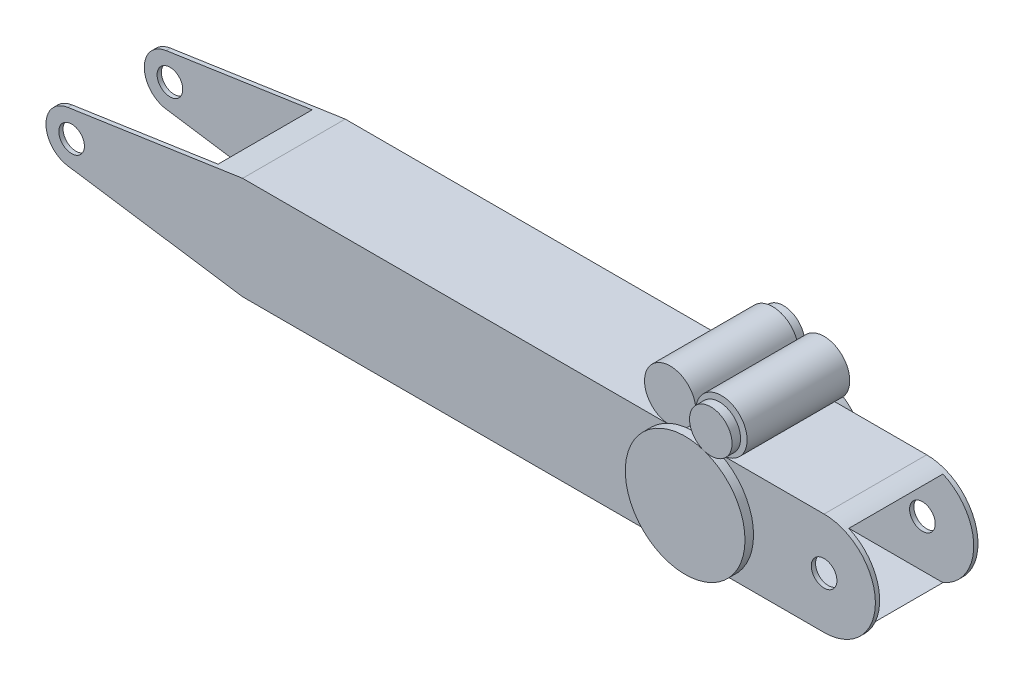
ISO-10303-21;
HEADER;
FILE_DESCRIPTION(('STEP AP214'),'2;1');
FILE_NAME('part.step','',(''),(''),'','','');
FILE_SCHEMA(('AUTOMOTIVE_DESIGN { 1 0 10303 214 1 1 1 1 }'));
ENDSEC;
DATA;
#1=APPLICATION_CONTEXT('core data for automotive mechanical design processes');
#2=APPLICATION_PROTOCOL_DEFINITION('international standard','automotive_design',2000,#1);
#3=PRODUCT_CONTEXT('',#1,'mechanical');
#4=PRODUCT('Part','Part','',(#3));
#5=PRODUCT_RELATED_PRODUCT_CATEGORY('part','',(#4));
#6=PRODUCT_DEFINITION_FORMATION('','',#4);
#7=PRODUCT_DEFINITION_CONTEXT('part definition',#1,'design');
#8=PRODUCT_DEFINITION('design','',#6,#7);
#9=PRODUCT_DEFINITION_SHAPE('','',#8);
#10=(LENGTH_UNIT() NAMED_UNIT(*) SI_UNIT(.MILLI.,.METRE.));
#11=(NAMED_UNIT(*) PLANE_ANGLE_UNIT() SI_UNIT($,.RADIAN.));
#12=(NAMED_UNIT(*) SI_UNIT($,.STERADIAN.) SOLID_ANGLE_UNIT());
#13=UNCERTAINTY_MEASURE_WITH_UNIT(LENGTH_MEASURE(1.E-05),#10,'distance_accuracy_value','');
#14=(GEOMETRIC_REPRESENTATION_CONTEXT(3) GLOBAL_UNCERTAINTY_ASSIGNED_CONTEXT((#13)) GLOBAL_UNIT_ASSIGNED_CONTEXT((#10,
#11,#12)) REPRESENTATION_CONTEXT('',''));
#15=CARTESIAN_POINT('',(0.,0.,0.));
#16=DIRECTION('',(0.,0.,1.));
#17=DIRECTION('',(1.,0.,0.));
#18=AXIS2_PLACEMENT_3D('',#15,#16,#17);
#19=CARTESIAN_POINT('',(165.1,57.15,-90.7022941905158));
#20=DIRECTION('',(0.,0.,1.));
#21=DIRECTION('',(1.,0.,0.));
#22=AXIS2_PLACEMENT_3D('',#19,#20,#21);
#23=CYLINDRICAL_SURFACE('',#22,15.7913894262076);
#24=CARTESIAN_POINT('',(165.1,57.15,-39.6875));
#25=DIRECTION('',(0.,0.,-1.));
#26=DIRECTION('',(-1.,0.,0.));
#27=AXIS2_PLACEMENT_3D('',#24,#25,#26);
#28=CIRCLE('',#27,15.7913894262076);
#29=CARTESIAN_POINT('',(149.308610573792,57.15,-39.6875));
#30=VERTEX_POINT('',#29);
#31=EDGE_CURVE('E75',#30,#30,#28,.T.);
#32=ORIENTED_EDGE('',*,*,#31,.T.);
#33=EDGE_LOOP('',(#32));
#34=FACE_BOUND('',#33,.T.);
#35=CARTESIAN_POINT('',(165.1,57.15,-46.0375));
#36=DIRECTION('',(0.,0.,-1.));
#37=DIRECTION('',(-1.,0.,0.));
#38=AXIS2_PLACEMENT_3D('',#35,#36,#37);
#39=CIRCLE('',#38,15.7913894262076);
#40=CARTESIAN_POINT('',(149.308610573792,57.15,-46.0375));
#41=VERTEX_POINT('',#40);
#42=EDGE_CURVE('E12',#41,#41,#39,.T.);
#43=ORIENTED_EDGE('',*,*,#42,.F.);
#44=EDGE_LOOP('',(#43));
#45=FACE_BOUND('',#44,.T.);
#46=ADVANCED_FACE('F68',(#34,#45),#23,.T.);
#47=CARTESIAN_POINT('',(165.1,57.15,-39.6875));
#48=DIRECTION('',(0.,0.,-1.));
#49=DIRECTION('',(-1.,0.,0.));
#50=AXIS2_PLACEMENT_3D('',#47,#48,#49);
#51=PLANE('',#50);
#52=ORIENTED_EDGE('',*,*,#31,.F.);
#53=EDGE_LOOP('',(#52));
#54=FACE_BOUND('',#53,.T.);
#55=ADVANCED_FACE('F83',(#54),#51,.F.);
#56=CARTESIAN_POINT('',(0.,0.,-46.0375));
#57=DIRECTION('',(0.,0.,-1.));
#58=DIRECTION('',(1.,0.,0.));
#59=AXIS2_PLACEMENT_3D('',#56,#57,#58);
#60=PLANE('',#59);
#61=ORIENTED_EDGE('',*,*,#42,.T.);
#62=EDGE_LOOP('',(#61));
#63=FACE_BOUND('',#62,.T.);
#64=ADVANCED_FACE('F70',(#63),#60,.T.);
#65=CLOSED_SHELL('',(#46,#55,#64));
#66=MANIFOLD_SOLID_BREP('B2',#65);
#67=CARTESIAN_POINT('',(0.,0.,-39.6875));
#68=DIRECTION('',(0.,0.,-1.));
#69=DIRECTION('',(1.,0.,0.));
#70=AXIS2_PLACEMENT_3D('',#67,#68,#69);
#71=PLANE('',#70);
#72=CARTESIAN_POINT('',(184.15,0.,-39.6875));
#73=DIRECTION('',(0.,0.,1.));
#74=DIRECTION('',(1.,0.,0.));
#75=AXIS2_PLACEMENT_3D('',#72,#73,#74);
#76=CIRCLE('',#75,44.45);
#77=CARTESIAN_POINT('',(228.6,0.,-39.6875));
#78=VERTEX_POINT('',#77);
#79=EDGE_CURVE('E121',#78,#78,#76,.T.);
#80=ORIENTED_EDGE('',*,*,#79,.T.);
#81=EDGE_LOOP('',(#80));
#82=FACE_BOUND('',#81,.T.);
#83=ADVANCED_FACE('F117',(#82),#71,.F.);
#84=CARTESIAN_POINT('',(184.15,0.,-46.0375));
#85=DIRECTION('',(0.,0.,1.));
#86=DIRECTION('',(-1.,0.,0.));
#87=AXIS2_PLACEMENT_3D('',#84,#85,#86);
#88=CYLINDRICAL_SURFACE('',#87,44.45);
#89=ORIENTED_EDGE('',*,*,#79,.F.);
#90=EDGE_LOOP('',(#89));
#91=FACE_BOUND('',#90,.T.);
#92=CARTESIAN_POINT('',(184.15,0.,-46.0375));
#93=DIRECTION('',(0.,0.,1.));
#94=DIRECTION('',(1.,0.,0.));
#95=AXIS2_PLACEMENT_3D('',#92,#93,#94);
#96=CIRCLE('',#95,44.45);
#97=CARTESIAN_POINT('',(228.6,0.,-46.0375));
#98=VERTEX_POINT('',#97);
#99=EDGE_CURVE('E67',#98,#98,#96,.T.);
#100=ORIENTED_EDGE('',*,*,#99,.T.);
#101=EDGE_LOOP('',(#100));
#102=FACE_BOUND('',#101,.T.);
#103=ADVANCED_FACE('F119',(#91,#102),#88,.T.);
#104=CARTESIAN_POINT('',(0.,0.,-46.0375));
#105=DIRECTION('',(0.,0.,-1.));
#106=DIRECTION('',(1.,0.,0.));
#107=AXIS2_PLACEMENT_3D('',#104,#105,#106);
#108=PLANE('',#107);
#109=ORIENTED_EDGE('',*,*,#99,.F.);
#110=EDGE_LOOP('',(#109));
#111=FACE_BOUND('',#110,.T.);
#112=ADVANCED_FACE('F132',(#111),#108,.T.);
#113=CLOSED_SHELL('',(#83,#103,#112));
#114=MANIFOLD_SOLID_BREP('B7',#113);
#115=CARTESIAN_POINT('',(203.2,57.15,46.0375));
#116=DIRECTION('',(0.,0.,-1.));
#117=DIRECTION('',(-1.,0.,0.));
#118=AXIS2_PLACEMENT_3D('',#115,#116,#117);
#119=CYLINDRICAL_SURFACE('',#118,15.7913894262076);
#120=CARTESIAN_POINT('',(203.2,57.15,39.6875));
#121=DIRECTION('',(0.,0.,1.));
#122=DIRECTION('',(1.,0.,0.));
#123=AXIS2_PLACEMENT_3D('',#120,#121,#122);
#124=CIRCLE('',#123,15.7913894262076);
#125=CARTESIAN_POINT('',(218.991389426208,57.15,39.6875));
#126=VERTEX_POINT('',#125);
#127=EDGE_CURVE('E116',#126,#126,#124,.T.);
#128=ORIENTED_EDGE('',*,*,#127,.T.);
#129=EDGE_LOOP('',(#128));
#130=FACE_BOUND('',#129,.T.);
#131=CARTESIAN_POINT('',(203.2,57.15,46.0375));
#132=DIRECTION('',(0.,0.,1.));
#133=DIRECTION('',(1.,0.,0.));
#134=AXIS2_PLACEMENT_3D('',#131,#132,#133);
#135=CIRCLE('',#134,15.7913894262076);
#136=CARTESIAN_POINT('',(218.991389426208,57.15,46.0375));
#137=VERTEX_POINT('',#136);
#138=EDGE_CURVE('E209',#137,#137,#135,.T.);
#139=ORIENTED_EDGE('',*,*,#138,.F.);
#140=EDGE_LOOP('',(#139));
#141=FACE_BOUND('',#140,.T.);
#142=ADVANCED_FACE('F205',(#130,#141),#119,.T.);
#143=CARTESIAN_POINT('',(0.,0.,46.0375));
#144=DIRECTION('',(0.,0.,1.));
#145=DIRECTION('',(1.,0.,0.));
#146=AXIS2_PLACEMENT_3D('',#143,#144,#145);
#147=PLANE('',#146);
#148=ORIENTED_EDGE('',*,*,#138,.T.);
#149=EDGE_LOOP('',(#148));
#150=FACE_BOUND('',#149,.T.);
#151=ADVANCED_FACE('F207',(#150),#147,.T.);
#152=CARTESIAN_POINT('',(0.,0.,39.6875));
#153=DIRECTION('',(0.,0.,1.));
#154=DIRECTION('',(1.,0.,0.));
#155=AXIS2_PLACEMENT_3D('',#152,#153,#154);
#156=PLANE('',#155);
#157=ORIENTED_EDGE('',*,*,#127,.F.);
#158=EDGE_LOOP('',(#157));
#159=FACE_BOUND('',#158,.T.);
#160=ADVANCED_FACE('F224',(#159),#156,.F.);
#161=CLOSED_SHELL('',(#142,#151,#160));
#162=MANIFOLD_SOLID_BREP('B62',#161);
#163=CARTESIAN_POINT('',(0.,0.,39.6875));
#164=DIRECTION('',(0.,0.,1.));
#165=DIRECTION('',(1.,0.,0.));
#166=AXIS2_PLACEMENT_3D('',#163,#164,#165);
#167=PLANE('',#166);
#168=CARTESIAN_POINT('',(184.15,0.,39.6875));
#169=DIRECTION('',(0.,0.,1.));
#170=DIRECTION('',(1.,0.,0.));
#171=AXIS2_PLACEMENT_3D('',#168,#169,#170);
#172=CIRCLE('',#171,44.45);
#173=CARTESIAN_POINT('',(228.6,0.,39.6875));
#174=VERTEX_POINT('',#173);
#175=EDGE_CURVE('E258',#174,#174,#172,.T.);
#176=ORIENTED_EDGE('',*,*,#175,.F.);
#177=EDGE_LOOP('',(#176));
#178=FACE_BOUND('',#177,.T.);
#179=ADVANCED_FACE('F254',(#178),#167,.F.);
#180=CARTESIAN_POINT('',(184.15,0.,46.0375));
#181=DIRECTION('',(0.,0.,-1.));
#182=DIRECTION('',(-1.,0.,0.));
#183=AXIS2_PLACEMENT_3D('',#180,#181,#182);
#184=CYLINDRICAL_SURFACE('',#183,44.45);
#185=ORIENTED_EDGE('',*,*,#175,.T.);
#186=EDGE_LOOP('',(#185));
#187=FACE_BOUND('',#186,.T.);
#188=CARTESIAN_POINT('',(184.15,0.,46.0375));
#189=DIRECTION('',(0.,0.,1.));
#190=DIRECTION('',(1.,0.,0.));
#191=AXIS2_PLACEMENT_3D('',#188,#189,#190);
#192=CIRCLE('',#191,44.45);
#193=CARTESIAN_POINT('',(228.6,0.,46.0375));
#194=VERTEX_POINT('',#193);
#195=EDGE_CURVE('E204',#194,#194,#192,.T.);
#196=ORIENTED_EDGE('',*,*,#195,.F.);
#197=EDGE_LOOP('',(#196));
#198=FACE_BOUND('',#197,.T.);
#199=ADVANCED_FACE('F256',(#187,#198),#184,.T.);
#200=CARTESIAN_POINT('',(0.,0.,46.0375));
#201=DIRECTION('',(0.,0.,1.));
#202=DIRECTION('',(1.,0.,0.));
#203=AXIS2_PLACEMENT_3D('',#200,#201,#202);
#204=PLANE('',#203);
#205=ORIENTED_EDGE('',*,*,#195,.T.);
#206=EDGE_LOOP('',(#205));
#207=FACE_BOUND('',#206,.T.);
#208=ADVANCED_FACE('F270',(#207),#204,.T.);
#209=CLOSED_SHELL('',(#179,#199,#208));
#210=MANIFOLD_SOLID_BREP('B111',#209);
#211=CARTESIAN_POINT('',(203.2,57.15,-91.981536726415));
#212=DIRECTION('',(0.,0.,1.));
#213=DIRECTION('',(1.,0.,0.));
#214=AXIS2_PLACEMENT_3D('',#211,#212,#213);
#215=CYLINDRICAL_SURFACE('',#214,19.05);
#216=CARTESIAN_POINT('',(203.2,57.15,-38.1));
#217=DIRECTION('',(0.,0.,1.));
#218=DIRECTION('',(1.,0.,0.));
#219=AXIS2_PLACEMENT_3D('',#216,#217,#218);
#220=CIRCLE('',#219,19.05);
#221=CARTESIAN_POINT('',(222.25,57.15,-38.1));
#222=VERTEX_POINT('',#221);
#223=EDGE_CURVE('E253',#222,#222,#220,.F.);
#224=ORIENTED_EDGE('',*,*,#223,.F.);
#225=EDGE_LOOP('',(#224));
#226=FACE_BOUND('',#225,.T.);
#227=CARTESIAN_POINT('',(203.2,57.15,38.1));
#228=DIRECTION('',(0.,0.,1.));
#229=DIRECTION('',(1.,0.,0.));
#230=AXIS2_PLACEMENT_3D('',#227,#228,#229);
#231=CIRCLE('',#230,19.05);
#232=CARTESIAN_POINT('',(222.25,57.15,38.1));
#233=VERTEX_POINT('',#232);
#234=EDGE_CURVE('E330',#233,#233,#231,.T.);
#235=ORIENTED_EDGE('',*,*,#234,.F.);
#236=EDGE_LOOP('',(#235));
#237=FACE_BOUND('',#236,.T.);
#238=ADVANCED_FACE('F324',(#226,#237),#215,.T.);
#239=CARTESIAN_POINT('',(0.,0.,38.1));
#240=DIRECTION('',(0.,0.,1.));
#241=DIRECTION('',(1.,0.,0.));
#242=AXIS2_PLACEMENT_3D('',#239,#240,#241);
#243=PLANE('',#242);
#244=ORIENTED_EDGE('',*,*,#234,.T.);
#245=EDGE_LOOP('',(#244));
#246=FACE_BOUND('',#245,.T.);
#247=ADVANCED_FACE('F336',(#246),#243,.T.);
#248=CARTESIAN_POINT('',(279.4,0.,-38.1));
#249=DIRECTION('',(0.,0.,1.));
#250=DIRECTION('',(1.,0.,0.));
#251=AXIS2_PLACEMENT_3D('',#248,#249,#250);
#252=PLANE('',#251);
#253=ORIENTED_EDGE('',*,*,#223,.T.);
#254=EDGE_LOOP('',(#253));
#255=FACE_BOUND('',#254,.T.);
#256=ADVANCED_FACE('F343',(#255),#252,.F.);
#257=CLOSED_SHELL('',(#238,#247,#256));
#258=MANIFOLD_SOLID_BREP('B199',#257);
#259=CARTESIAN_POINT('',(165.1,57.15,-91.981536726415));
#260=DIRECTION('',(0.,0.,1.));
#261=DIRECTION('',(1.,0.,0.));
#262=AXIS2_PLACEMENT_3D('',#259,#260,#261);
#263=CYLINDRICAL_SURFACE('',#262,19.05);
#264=CARTESIAN_POINT('',(165.1,57.15,-38.1));
#265=DIRECTION('',(0.,0.,1.));
#266=DIRECTION('',(1.,0.,0.));
#267=AXIS2_PLACEMENT_3D('',#264,#265,#266);
#268=CIRCLE('',#267,19.05);
#269=CARTESIAN_POINT('',(184.15,57.15,-38.1));
#270=VERTEX_POINT('',#269);
#271=EDGE_CURVE('E323',#270,#270,#268,.F.);
#272=ORIENTED_EDGE('',*,*,#271,.F.);
#273=EDGE_LOOP('',(#272));
#274=FACE_BOUND('',#273,.T.);
#275=CARTESIAN_POINT('',(165.1,57.15,38.1));
#276=DIRECTION('',(0.,0.,1.));
#277=DIRECTION('',(1.,0.,0.));
#278=AXIS2_PLACEMENT_3D('',#275,#276,#277);
#279=CIRCLE('',#278,19.05);
#280=CARTESIAN_POINT('',(184.15,57.15,38.1));
#281=VERTEX_POINT('',#280);
#282=EDGE_CURVE('E380',#281,#281,#279,.T.);
#283=ORIENTED_EDGE('',*,*,#282,.F.);
#284=EDGE_LOOP('',(#283));
#285=FACE_BOUND('',#284,.T.);
#286=ADVANCED_FACE('F374',(#274,#285),#263,.T.);
#287=CARTESIAN_POINT('',(0.,0.,38.1));
#288=DIRECTION('',(0.,0.,1.));
#289=DIRECTION('',(1.,0.,0.));
#290=AXIS2_PLACEMENT_3D('',#287,#288,#289);
#291=PLANE('',#290);
#292=ORIENTED_EDGE('',*,*,#282,.T.);
#293=EDGE_LOOP('',(#292));
#294=FACE_BOUND('',#293,.T.);
#295=ADVANCED_FACE('F386',(#294),#291,.T.);
#296=CARTESIAN_POINT('',(279.4,0.,-38.1));
#297=DIRECTION('',(0.,0.,1.));
#298=DIRECTION('',(1.,0.,0.));
#299=AXIS2_PLACEMENT_3D('',#296,#297,#298);
#300=PLANE('',#299);
#301=ORIENTED_EDGE('',*,*,#271,.T.);
#302=EDGE_LOOP('',(#301));
#303=FACE_BOUND('',#302,.T.);
#304=ADVANCED_FACE('F393',(#303),#300,.F.);
#305=CLOSED_SHELL('',(#286,#295,#304));
#306=MANIFOLD_SOLID_BREP('B248',#305);
#307=CARTESIAN_POINT('',(-279.4,0.,38.1));
#308=DIRECTION('',(0.,0.,-1.));
#309=DIRECTION('',(-1.,0.,0.));
#310=AXIS2_PLACEMENT_3D('',#307,#308,#309);
#311=CYLINDRICAL_SURFACE('',#310,19.05);
#312=CARTESIAN_POINT('',(-279.4,0.,-34.925));
#313=DIRECTION('',(0.,0.,-1.));
#314=DIRECTION('',(-1.,0.,0.));
#315=AXIS2_PLACEMENT_3D('',#312,#313,#314);
#316=CIRCLE('',#315,19.05);
#317=CARTESIAN_POINT('',(-282.195625509059,-18.8437516968648,-34.925));
#318=VERTEX_POINT('',#317);
#319=CARTESIAN_POINT('',(-282.195625509059,18.8437516968648,-34.925));
#320=VERTEX_POINT('',#319);
#321=EDGE_CURVE('E438',#318,#320,#316,.T.);
#322=ORIENTED_EDGE('',*,*,#321,.T.);
#323=DIRECTION('',(0.,0.,-1.));
#324=VECTOR('',#323,1.);
#325=CARTESIAN_POINT('',(-282.195625509059,18.8437516968648,38.1));
#326=LINE('',#325,#324);
#327=CARTESIAN_POINT('',(-282.195625509059,18.8437516968648,-38.1));
#328=VERTEX_POINT('',#327);
#329=EDGE_CURVE('E521',#320,#328,#326,.T.);
#330=ORIENTED_EDGE('',*,*,#329,.T.);
#331=CARTESIAN_POINT('',(-279.4,0.,-38.1));
#332=DIRECTION('',(0.,0.,1.));
#333=DIRECTION('',(1.,0.,0.));
#334=AXIS2_PLACEMENT_3D('',#331,#332,#333);
#335=CIRCLE('',#334,19.05);
#336=CARTESIAN_POINT('',(-282.195625509059,-18.8437516968648,-38.1));
#337=VERTEX_POINT('',#336);
#338=EDGE_CURVE('E579',#328,#337,#335,.T.);
#339=ORIENTED_EDGE('',*,*,#338,.T.);
#340=DIRECTION('',(0.,0.,-1.));
#341=VECTOR('',#340,1.);
#342=CARTESIAN_POINT('',(-282.195625509059,-18.8437516968648,38.1));
#343=LINE('',#342,#341);
#344=EDGE_CURVE('E590',#318,#337,#343,.T.);
#345=ORIENTED_EDGE('',*,*,#344,.F.);
#346=EDGE_LOOP('',(#322,#330,#339,#345));
#347=FACE_BOUND('',#346,.T.);
#348=ADVANCED_FACE('F415',(#347),#311,.T.);
#349=CARTESIAN_POINT('',(279.4,0.,38.1));
#350=DIRECTION('',(0.,0.,-1.));
#351=DIRECTION('',(-1.,0.,0.));
#352=AXIS2_PLACEMENT_3D('',#349,#350,#351);
#353=CYLINDRICAL_SURFACE('',#352,9.52500000000002);
#354=CARTESIAN_POINT('',(279.4,0.,34.925));
#355=DIRECTION('',(0.,0.,1.));
#356=DIRECTION('',(1.,0.,0.));
#357=AXIS2_PLACEMENT_3D('',#354,#355,#356);
#358=CIRCLE('',#357,9.52500000000002);
#359=CARTESIAN_POINT('',(288.925,0.,34.925));
#360=VERTEX_POINT('',#359);
#361=EDGE_CURVE('E529',#360,#360,#358,.T.);
#362=ORIENTED_EDGE('',*,*,#361,.F.);
#363=EDGE_LOOP('',(#362));
#364=FACE_BOUND('',#363,.T.);
#365=CARTESIAN_POINT('',(279.4,0.,38.1));
#366=DIRECTION('',(0.,0.,1.));
#367=DIRECTION('',(1.,0.,0.));
#368=AXIS2_PLACEMENT_3D('',#365,#366,#367);
#369=CIRCLE('',#368,9.52500000000002);
#370=CARTESIAN_POINT('',(288.925,0.,38.1));
#371=VERTEX_POINT('',#370);
#372=EDGE_CURVE('E552',#371,#371,#369,.T.);
#373=ORIENTED_EDGE('',*,*,#372,.T.);
#374=EDGE_LOOP('',(#373));
#375=FACE_BOUND('',#374,.T.);
#376=ADVANCED_FACE('F637',(#364,#375),#353,.F.);
#377=CARTESIAN_POINT('',(-279.4,0.,38.1));
#378=DIRECTION('',(0.,0.,-1.));
#379=DIRECTION('',(-1.,0.,0.));
#380=AXIS2_PLACEMENT_3D('',#377,#378,#379);
#381=CYLINDRICAL_SURFACE('',#380,9.52500000000002);
#382=CARTESIAN_POINT('',(-279.4,0.,34.925));
#383=DIRECTION('',(0.,0.,1.));
#384=DIRECTION('',(1.,0.,0.));
#385=AXIS2_PLACEMENT_3D('',#382,#383,#384);
#386=CIRCLE('',#385,9.52500000000002);
#387=CARTESIAN_POINT('',(-269.875,0.,34.925));
#388=VERTEX_POINT('',#387);
#389=EDGE_CURVE('E523',#388,#388,#386,.T.);
#390=ORIENTED_EDGE('',*,*,#389,.F.);
#391=EDGE_LOOP('',(#390));
#392=FACE_BOUND('',#391,.T.);
#393=CARTESIAN_POINT('',(-279.4,0.,38.1));
#394=DIRECTION('',(0.,0.,1.));
#395=DIRECTION('',(1.,0.,0.));
#396=AXIS2_PLACEMENT_3D('',#393,#394,#395);
#397=CIRCLE('',#396,9.52500000000002);
#398=CARTESIAN_POINT('',(-269.875,0.,38.1));
#399=VERTEX_POINT('',#398);
#400=EDGE_CURVE('E546',#399,#399,#397,.T.);
#401=ORIENTED_EDGE('',*,*,#400,.T.);
#402=EDGE_LOOP('',(#401));
#403=FACE_BOUND('',#402,.T.);
#404=ADVANCED_FACE('F651',(#392,#403),#381,.F.);
#405=CARTESIAN_POINT('',(279.4,0.,38.1));
#406=DIRECTION('',(0.,0.,1.));
#407=DIRECTION('',(1.,0.,0.));
#408=AXIS2_PLACEMENT_3D('',#405,#406,#407);
#409=PLANE('',#408);
#410=ORIENTED_EDGE('',*,*,#372,.F.);
#411=EDGE_LOOP('',(#410));
#412=FACE_BOUND('',#411,.T.);
#413=CARTESIAN_POINT('',(279.4,0.,38.1));
#414=DIRECTION('',(0.,0.,1.));
#415=DIRECTION('',(1.,0.,0.));
#416=AXIS2_PLACEMENT_3D('',#413,#414,#415);
#417=CIRCLE('',#416,38.1);
#418=CARTESIAN_POINT('',(279.4,-38.1,38.1));
#419=VERTEX_POINT('',#418);
#420=CARTESIAN_POINT('',(279.4,38.1,38.1));
#421=VERTEX_POINT('',#420);
#422=EDGE_CURVE('E558',#419,#421,#417,.T.);
#423=ORIENTED_EDGE('',*,*,#422,.T.);
#424=DIRECTION('',(-1.,0.,0.));
#425=VECTOR('',#424,1.);
#426=CARTESIAN_POINT('',(-152.4,38.1,38.1));
#427=LINE('',#426,#425);
#428=CARTESIAN_POINT('',(-152.4,38.1,38.1));
#429=VERTEX_POINT('',#428);
#430=EDGE_CURVE('E561',#421,#429,#427,.T.);
#431=ORIENTED_EDGE('',*,*,#430,.T.);
#432=DIRECTION('',(-0.989173317420726,-0.146751995226218,0.));
#433=VECTOR('',#432,1.);
#434=CARTESIAN_POINT('',(-282.195625509059,18.8437516968648,38.1));
#435=LINE('',#434,#433);
#436=CARTESIAN_POINT('',(-282.195625509059,18.8437516968648,38.1));
#437=VERTEX_POINT('',#436);
#438=EDGE_CURVE('E564',#429,#437,#435,.T.);
#439=ORIENTED_EDGE('',*,*,#438,.T.);
#440=CARTESIAN_POINT('',(-279.4,0.,38.1));
#441=DIRECTION('',(0.,0.,1.));
#442=DIRECTION('',(1.,0.,0.));
#443=AXIS2_PLACEMENT_3D('',#440,#441,#442);
#444=CIRCLE('',#443,19.05);
#445=CARTESIAN_POINT('',(-282.195625509059,-18.8437516968648,38.1));
#446=VERTEX_POINT('',#445);
#447=EDGE_CURVE('E566',#437,#446,#444,.T.);
#448=ORIENTED_EDGE('',*,*,#447,.T.);
#449=DIRECTION('',(0.989173317420726,-0.146751995226218,0.));
#450=VECTOR('',#449,1.);
#451=CARTESIAN_POINT('',(-282.195625509059,-18.8437516968648,38.1));
#452=LINE('',#451,#450);
#453=CARTESIAN_POINT('',(-152.4,-38.1,38.1));
#454=VERTEX_POINT('',#453);
#455=EDGE_CURVE('E568',#446,#454,#452,.T.);
#456=ORIENTED_EDGE('',*,*,#455,.T.);
#457=DIRECTION('',(1.,0.,0.));
#458=VECTOR('',#457,1.);
#459=CARTESIAN_POINT('',(-152.4,-38.1,38.1));
#460=LINE('',#459,#458);
#461=EDGE_CURVE('E570',#454,#419,#460,.T.);
#462=ORIENTED_EDGE('',*,*,#461,.T.);
#463=EDGE_LOOP('',(#423,#431,#439,#448,#456,#462));
#464=FACE_BOUND('',#463,.T.);
#465=ORIENTED_EDGE('',*,*,#400,.F.);
#466=EDGE_LOOP('',(#465));
#467=FACE_BOUND('',#466,.T.);
#468=ADVANCED_FACE('F643',(#412,#464,#467),#409,.T.);
#469=CARTESIAN_POINT('',(279.4,0.,-38.1));
#470=DIRECTION('',(0.,0.,1.));
#471=DIRECTION('',(1.,0.,0.));
#472=AXIS2_PLACEMENT_3D('',#469,#470,#471);
#473=PLANE('',#472);
#474=CARTESIAN_POINT('',(279.4,0.,-38.1));
#475=DIRECTION('',(0.,0.,1.));
#476=DIRECTION('',(1.,0.,0.));
#477=AXIS2_PLACEMENT_3D('',#474,#475,#476);
#478=CIRCLE('',#477,38.1);
#479=CARTESIAN_POINT('',(279.4,-38.1,-38.1));
#480=VERTEX_POINT('',#479);
#481=CARTESIAN_POINT('',(279.4,38.1,-38.1));
#482=VERTEX_POINT('',#481);
#483=EDGE_CURVE('E555',#480,#482,#478,.T.);
#484=ORIENTED_EDGE('',*,*,#483,.F.);
#485=DIRECTION('',(1.,0.,0.));
#486=VECTOR('',#485,1.);
#487=CARTESIAN_POINT('',(-152.4,-38.1,-38.1));
#488=LINE('',#487,#486);
#489=CARTESIAN_POINT('',(-152.4,-38.1,-38.1));
#490=VERTEX_POINT('',#489);
#491=EDGE_CURVE('E562',#490,#480,#488,.T.);
#492=ORIENTED_EDGE('',*,*,#491,.F.);
#493=DIRECTION('',(0.989173317420726,-0.146751995226218,0.));
#494=VECTOR('',#493,1.);
#495=CARTESIAN_POINT('',(-282.195625509059,-18.8437516968648,-38.1));
#496=LINE('',#495,#494);
#497=EDGE_CURVE('E582',#337,#490,#496,.T.);
#498=ORIENTED_EDGE('',*,*,#497,.F.);
#499=ORIENTED_EDGE('',*,*,#338,.F.);
#500=DIRECTION('',(-0.989173317420726,-0.146751995226218,0.));
#501=VECTOR('',#500,1.);
#502=CARTESIAN_POINT('',(-282.195625509059,18.8437516968648,-38.1));
#503=LINE('',#502,#501);
#504=CARTESIAN_POINT('',(-152.4,38.1,-38.1));
#505=VERTEX_POINT('',#504);
#506=EDGE_CURVE('E577',#505,#328,#503,.T.);
#507=ORIENTED_EDGE('',*,*,#506,.F.);
#508=DIRECTION('',(-1.,0.,0.));
#509=VECTOR('',#508,1.);
#510=CARTESIAN_POINT('',(-152.4,38.1,-38.1));
#511=LINE('',#510,#509);
#512=EDGE_CURVE('E575',#482,#505,#511,.T.);
#513=ORIENTED_EDGE('',*,*,#512,.F.);
#514=EDGE_LOOP('',(#484,#492,#498,#499,#507,#513));
#515=FACE_BOUND('',#514,.T.);
#516=CARTESIAN_POINT('',(279.4,0.,-38.1));
#517=DIRECTION('',(0.,0.,1.));
#518=DIRECTION('',(1.,0.,0.));
#519=AXIS2_PLACEMENT_3D('',#516,#517,#518);
#520=CIRCLE('',#519,9.52500000000002);
#521=CARTESIAN_POINT('',(288.925,0.,-38.1));
#522=VERTEX_POINT('',#521);
#523=EDGE_CURVE('E549',#522,#522,#520,.T.);
#524=ORIENTED_EDGE('',*,*,#523,.T.);
#525=EDGE_LOOP('',(#524));
#526=FACE_BOUND('',#525,.T.);
#527=CARTESIAN_POINT('',(-279.4,0.,-38.1));
#528=DIRECTION('',(0.,0.,1.));
#529=DIRECTION('',(1.,0.,0.));
#530=AXIS2_PLACEMENT_3D('',#527,#528,#529);
#531=CIRCLE('',#530,9.52500000000002);
#532=CARTESIAN_POINT('',(-269.875,0.,-38.1));
#533=VERTEX_POINT('',#532);
#534=EDGE_CURVE('E545',#533,#533,#531,.T.);
#535=ORIENTED_EDGE('',*,*,#534,.T.);
#536=EDGE_LOOP('',(#535));
#537=FACE_BOUND('',#536,.T.);
#538=ADVANCED_FACE('F640',(#515,#526,#537),#473,.F.);
#539=CARTESIAN_POINT('',(279.4,0.,38.1));
#540=DIRECTION('',(0.,0.,-1.));
#541=DIRECTION('',(-1.,0.,0.));
#542=AXIS2_PLACEMENT_3D('',#539,#540,#541);
#543=CYLINDRICAL_SURFACE('',#542,38.1);
#544=CARTESIAN_POINT('',(279.4,0.,34.925));
#545=DIRECTION('',(0.,0.,1.));
#546=DIRECTION('',(1.,0.,0.));
#547=AXIS2_PLACEMENT_3D('',#544,#545,#546);
#548=CIRCLE('',#547,38.1);
#549=CARTESIAN_POINT('',(294.626765086518,-34.925,34.925));
#550=VERTEX_POINT('',#549);
#551=CARTESIAN_POINT('',(294.626765086518,34.925,34.925));
#552=VERTEX_POINT('',#551);
#553=EDGE_CURVE('E539',#550,#552,#548,.T.);
#554=ORIENTED_EDGE('',*,*,#553,.T.);
#555=DIRECTION('',(0.,0.,-1.));
#556=VECTOR('',#555,1.);
#557=CARTESIAN_POINT('',(294.626765086518,34.925,38.1));
#558=LINE('',#557,#556);
#559=CARTESIAN_POINT('',(294.626765086518,34.925,-34.925));
#560=VERTEX_POINT('',#559);
#561=EDGE_CURVE('E543',#552,#560,#558,.T.);
#562=ORIENTED_EDGE('',*,*,#561,.T.);
#563=CARTESIAN_POINT('',(279.4,0.,-34.925));
#564=DIRECTION('',(0.,0.,-1.));
#565=DIRECTION('',(-1.,0.,0.));
#566=AXIS2_PLACEMENT_3D('',#563,#564,#565);
#567=CIRCLE('',#566,38.1);
#568=CARTESIAN_POINT('',(294.626765086518,-34.925,-34.925));
#569=VERTEX_POINT('',#568);
#570=EDGE_CURVE('E430',#560,#569,#567,.T.);
#571=ORIENTED_EDGE('',*,*,#570,.T.);
#572=DIRECTION('',(0.,0.,-1.));
#573=VECTOR('',#572,1.);
#574=CARTESIAN_POINT('',(294.626765086518,-34.925,38.1));
#575=LINE('',#574,#573);
#576=EDGE_CURVE('E541',#569,#550,#575,.F.);
#577=ORIENTED_EDGE('',*,*,#576,.T.);
#578=EDGE_LOOP('',(#554,#562,#571,#577));
#579=FACE_BOUND('',#578,.T.);
#580=ORIENTED_EDGE('',*,*,#483,.T.);
#581=DIRECTION('',(0.,0.,-1.));
#582=VECTOR('',#581,1.);
#583=CARTESIAN_POINT('',(279.4,38.1,38.1));
#584=LINE('',#583,#582);
#585=EDGE_CURVE('E600',#421,#482,#584,.T.);
#586=ORIENTED_EDGE('',*,*,#585,.F.);
#587=ORIENTED_EDGE('',*,*,#422,.F.);
#588=DIRECTION('',(0.,0.,-1.));
#589=VECTOR('',#588,1.);
#590=CARTESIAN_POINT('',(279.4,-38.1,38.1));
#591=LINE('',#590,#589);
#592=EDGE_CURVE('E572',#419,#480,#591,.T.);
#593=ORIENTED_EDGE('',*,*,#592,.T.);
#594=EDGE_LOOP('',(#580,#586,#587,#593));
#595=FACE_BOUND('',#594,.T.);
#596=ADVANCED_FACE('F417',(#579,#595),#543,.T.);
#597=CARTESIAN_POINT('',(-152.4,38.1,38.1));
#598=DIRECTION('',(0.,-1.,0.));
#599=DIRECTION('',(1.,0.,0.));
#600=AXIS2_PLACEMENT_3D('',#597,#598,#599);
#601=PLANE('',#600);
#602=ORIENTED_EDGE('',*,*,#512,.T.);
#603=DIRECTION('',(0.,0.,-1.));
#604=VECTOR('',#603,1.);
#605=CARTESIAN_POINT('',(-152.4,38.1,38.1));
#606=LINE('',#605,#604);
#607=EDGE_CURVE('E597',#429,#505,#606,.T.);
#608=ORIENTED_EDGE('',*,*,#607,.F.);
#609=ORIENTED_EDGE('',*,*,#430,.F.);
#610=ORIENTED_EDGE('',*,*,#585,.T.);
#611=EDGE_LOOP('',(#602,#608,#609,#610));
#612=FACE_BOUND('',#611,.T.);
#613=ADVANCED_FACE('F676',(#612),#601,.F.);
#614=CARTESIAN_POINT('',(-282.195625509059,18.8437516968648,38.1));
#615=DIRECTION('',(0.146751995226218,-0.989173317420726,0.));
#616=DIRECTION('',(0.989173317420726,0.146751995226218,0.));
#617=AXIS2_PLACEMENT_3D('',#614,#615,#616);
#618=PLANE('',#617);
#619=DIRECTION('',(0.,0.,1.));
#620=VECTOR('',#619,1.);
#621=CARTESIAN_POINT('',(-173.800903462808,34.925,38.1));
#622=LINE('',#621,#620);
#623=CARTESIAN_POINT('',(-173.800903462808,34.925,-34.925));
#624=VERTEX_POINT('',#623);
#625=CARTESIAN_POINT('',(-173.800903462808,34.925,34.925));
#626=VERTEX_POINT('',#625);
#627=EDGE_CURVE('E372',#624,#626,#622,.T.);
#628=ORIENTED_EDGE('',*,*,#627,.T.);
#629=DIRECTION('',(-0.989173317420726,-0.146751995226218,0.));
#630=VECTOR('',#629,1.);
#631=CARTESIAN_POINT('',(-282.195625509059,18.8437516968648,34.925));
#632=LINE('',#631,#630);
#633=CARTESIAN_POINT('',(-282.195625509059,18.8437516968648,34.925));
#634=VERTEX_POINT('',#633);
#635=EDGE_CURVE('E537',#626,#634,#632,.T.);
#636=ORIENTED_EDGE('',*,*,#635,.T.);
#637=EDGE_CURVE('E594',#437,#634,#326,.T.);
#638=ORIENTED_EDGE('',*,*,#637,.F.);
#639=ORIENTED_EDGE('',*,*,#438,.F.);
#640=ORIENTED_EDGE('',*,*,#607,.T.);
#641=ORIENTED_EDGE('',*,*,#506,.T.);
#642=ORIENTED_EDGE('',*,*,#329,.F.);
#643=DIRECTION('',(0.989173317420726,0.146751995226218,0.));
#644=VECTOR('',#643,1.);
#645=CARTESIAN_POINT('',(-282.195625509059,18.8437516968648,-34.925));
#646=LINE('',#645,#644);
#647=EDGE_CURVE('E515',#320,#624,#646,.T.);
#648=ORIENTED_EDGE('',*,*,#647,.T.);
#649=EDGE_LOOP('',(#628,#636,#638,#639,#640,#641,#642,#648));
#650=FACE_BOUND('',#649,.T.);
#651=ADVANCED_FACE('F519',(#650),#618,.F.);
#652=CARTESIAN_POINT('',(-279.4,0.,34.925));
#653=DIRECTION('',(0.,0.,1.));
#654=DIRECTION('',(1.,0.,0.));
#655=AXIS2_PLACEMENT_3D('',#652,#653,#654);
#656=CIRCLE('',#655,19.05);
#657=CARTESIAN_POINT('',(-282.195625509059,-18.8437516968648,34.925));
#658=VERTEX_POINT('',#657);
#659=EDGE_CURVE('E535',#634,#658,#656,.T.);
#660=ORIENTED_EDGE('',*,*,#659,.T.);
#661=EDGE_CURVE('E591',#446,#658,#343,.T.);
#662=ORIENTED_EDGE('',*,*,#661,.F.);
#663=ORIENTED_EDGE('',*,*,#447,.F.);
#664=ORIENTED_EDGE('',*,*,#637,.T.);
#665=EDGE_LOOP('',(#660,#662,#663,#664));
#666=FACE_BOUND('',#665,.T.);
#667=ADVANCED_FACE('F663',(#666),#311,.T.);
#668=CARTESIAN_POINT('',(-282.195625509059,-18.8437516968648,38.1));
#669=DIRECTION('',(0.146751995226218,0.989173317420726,0.));
#670=DIRECTION('',(-0.989173317420726,0.146751995226218,0.));
#671=AXIS2_PLACEMENT_3D('',#668,#669,#670);
#672=PLANE('',#671);
#673=ORIENTED_EDGE('',*,*,#661,.T.);
#674=DIRECTION('',(0.989173317420726,-0.146751995226218,0.));
#675=VECTOR('',#674,1.);
#676=CARTESIAN_POINT('',(-282.195625509059,-18.8437516968648,34.925));
#677=LINE('',#676,#675);
#678=CARTESIAN_POINT('',(-173.800903462808,-34.925,34.925));
#679=VERTEX_POINT('',#678);
#680=EDGE_CURVE('E532',#658,#679,#677,.T.);
#681=ORIENTED_EDGE('',*,*,#680,.T.);
#682=DIRECTION('',(0.,0.,-1.));
#683=VECTOR('',#682,1.);
#684=CARTESIAN_POINT('',(-173.800903462808,-34.925,38.1));
#685=LINE('',#684,#683);
#686=CARTESIAN_POINT('',(-173.800903462808,-34.925,-34.925));
#687=VERTEX_POINT('',#686);
#688=EDGE_CURVE('E423',#679,#687,#685,.T.);
#689=ORIENTED_EDGE('',*,*,#688,.T.);
#690=DIRECTION('',(-0.989173317420726,0.146751995226218,0.));
#691=VECTOR('',#690,1.);
#692=CARTESIAN_POINT('',(-282.195625509059,-18.8437516968648,-34.925));
#693=LINE('',#692,#691);
#694=EDGE_CURVE('E525',#687,#318,#693,.T.);
#695=ORIENTED_EDGE('',*,*,#694,.T.);
#696=ORIENTED_EDGE('',*,*,#344,.T.);
#697=ORIENTED_EDGE('',*,*,#497,.T.);
#698=DIRECTION('',(0.,0.,-1.));
#699=VECTOR('',#698,1.);
#700=CARTESIAN_POINT('',(-152.4,-38.1,38.1));
#701=LINE('',#700,#699);
#702=EDGE_CURVE('E587',#454,#490,#701,.T.);
#703=ORIENTED_EDGE('',*,*,#702,.F.);
#704=ORIENTED_EDGE('',*,*,#455,.F.);
#705=EDGE_LOOP('',(#673,#681,#689,#695,#696,#697,#703,#704));
#706=FACE_BOUND('',#705,.T.);
#707=ADVANCED_FACE('F611',(#706),#672,.F.);
#708=CARTESIAN_POINT('',(-152.4,-38.1,38.1));
#709=DIRECTION('',(0.,1.,0.));
#710=DIRECTION('',(-1.,0.,0.));
#711=AXIS2_PLACEMENT_3D('',#708,#709,#710);
#712=PLANE('',#711);
#713=ORIENTED_EDGE('',*,*,#491,.T.);
#714=ORIENTED_EDGE('',*,*,#592,.F.);
#715=ORIENTED_EDGE('',*,*,#461,.F.);
#716=ORIENTED_EDGE('',*,*,#702,.T.);
#717=EDGE_LOOP('',(#713,#714,#715,#716));
#718=FACE_BOUND('',#717,.T.);
#719=ADVANCED_FACE('F635',(#718),#712,.F.);
#720=CARTESIAN_POINT('',(279.4,0.,-34.925));
#721=DIRECTION('',(0.,0.,-1.));
#722=DIRECTION('',(-1.,0.,0.));
#723=AXIS2_PLACEMENT_3D('',#720,#721,#722);
#724=CIRCLE('',#723,9.52500000000002);
#725=CARTESIAN_POINT('',(269.875,0.,-34.925));
#726=VERTEX_POINT('',#725);
#727=EDGE_CURVE('E606',#726,#726,#724,.T.);
#728=ORIENTED_EDGE('',*,*,#727,.F.);
#729=EDGE_LOOP('',(#728));
#730=FACE_BOUND('',#729,.T.);
#731=ORIENTED_EDGE('',*,*,#523,.F.);
#732=EDGE_LOOP('',(#731));
#733=FACE_BOUND('',#732,.T.);
#734=ADVANCED_FACE('F631',(#730,#733),#353,.F.);
#735=CARTESIAN_POINT('',(-279.4,0.,-34.925));
#736=DIRECTION('',(0.,0.,-1.));
#737=DIRECTION('',(-1.,0.,0.));
#738=AXIS2_PLACEMENT_3D('',#735,#736,#737);
#739=CIRCLE('',#738,9.52500000000002);
#740=CARTESIAN_POINT('',(-288.925,0.,-34.925));
#741=VERTEX_POINT('',#740);
#742=EDGE_CURVE('E603',#741,#741,#739,.T.);
#743=ORIENTED_EDGE('',*,*,#742,.F.);
#744=EDGE_LOOP('',(#743));
#745=FACE_BOUND('',#744,.T.);
#746=ORIENTED_EDGE('',*,*,#534,.F.);
#747=EDGE_LOOP('',(#746));
#748=FACE_BOUND('',#747,.T.);
#749=ADVANCED_FACE('F634',(#745,#748),#381,.F.);
#750=CARTESIAN_POINT('',(-298.45,34.925,-34.925));
#751=DIRECTION('',(0.,1.,0.));
#752=DIRECTION('',(0.,0.,1.));
#753=AXIS2_PLACEMENT_3D('',#750,#751,#752);
#754=PLANE('',#753);
#755=DIRECTION('',(1.,0.,0.));
#756=VECTOR('',#755,1.);
#757=CARTESIAN_POINT('',(-298.45,34.925,34.925));
#758=LINE('',#757,#756);
#759=EDGE_CURVE('E510',#626,#552,#758,.T.);
#760=ORIENTED_EDGE('',*,*,#759,.F.);
#761=ORIENTED_EDGE('',*,*,#627,.F.);
#762=DIRECTION('',(1.,0.,0.));
#763=VECTOR('',#762,1.);
#764=CARTESIAN_POINT('',(-298.45,34.925,-34.925));
#765=LINE('',#764,#763);
#766=EDGE_CURVE('E508',#624,#560,#765,.T.);
#767=ORIENTED_EDGE('',*,*,#766,.T.);
#768=ORIENTED_EDGE('',*,*,#561,.F.);
#769=EDGE_LOOP('',(#760,#761,#767,#768));
#770=FACE_BOUND('',#769,.T.);
#771=ADVANCED_FACE('F506',(#770),#754,.F.);
#772=CARTESIAN_POINT('',(-298.45,-34.925,34.925));
#773=DIRECTION('',(0.,-1.,0.));
#774=DIRECTION('',(0.,0.,-1.));
#775=AXIS2_PLACEMENT_3D('',#772,#773,#774);
#776=PLANE('',#775);
#777=DIRECTION('',(1.,0.,0.));
#778=VECTOR('',#777,1.);
#779=CARTESIAN_POINT('',(-298.45,-34.925,-34.925));
#780=LINE('',#779,#778);
#781=EDGE_CURVE('E517',#687,#569,#780,.T.);
#782=ORIENTED_EDGE('',*,*,#781,.F.);
#783=ORIENTED_EDGE('',*,*,#688,.F.);
#784=DIRECTION('',(1.,0.,0.));
#785=VECTOR('',#784,1.);
#786=CARTESIAN_POINT('',(-298.45,-34.925,34.925));
#787=LINE('',#786,#785);
#788=EDGE_CURVE('E607',#679,#550,#787,.T.);
#789=ORIENTED_EDGE('',*,*,#788,.T.);
#790=ORIENTED_EDGE('',*,*,#576,.F.);
#791=EDGE_LOOP('',(#782,#783,#789,#790));
#792=FACE_BOUND('',#791,.T.);
#793=ADVANCED_FACE('F618',(#792),#776,.F.);
#794=CARTESIAN_POINT('',(-298.45,34.925,34.925));
#795=DIRECTION('',(0.,0.,1.));
#796=DIRECTION('',(1.,0.,0.));
#797=AXIS2_PLACEMENT_3D('',#794,#795,#796);
#798=PLANE('',#797);
#799=ORIENTED_EDGE('',*,*,#361,.T.);
#800=EDGE_LOOP('',(#799));
#801=FACE_BOUND('',#800,.T.);
#802=ORIENTED_EDGE('',*,*,#389,.T.);
#803=EDGE_LOOP('',(#802));
#804=FACE_BOUND('',#803,.T.);
#805=ORIENTED_EDGE('',*,*,#553,.F.);
#806=ORIENTED_EDGE('',*,*,#788,.F.);
#807=ORIENTED_EDGE('',*,*,#680,.F.);
#808=ORIENTED_EDGE('',*,*,#659,.F.);
#809=ORIENTED_EDGE('',*,*,#635,.F.);
#810=ORIENTED_EDGE('',*,*,#759,.T.);
#811=EDGE_LOOP('',(#805,#806,#807,#808,#809,#810));
#812=FACE_BOUND('',#811,.T.);
#813=ADVANCED_FACE('F621',(#801,#804,#812),#798,.F.);
#814=CARTESIAN_POINT('',(-298.45,-34.925,-34.925));
#815=DIRECTION('',(0.,0.,-1.));
#816=DIRECTION('',(-1.,0.,0.));
#817=AXIS2_PLACEMENT_3D('',#814,#815,#816);
#818=PLANE('',#817);
#819=ORIENTED_EDGE('',*,*,#727,.T.);
#820=EDGE_LOOP('',(#819));
#821=FACE_BOUND('',#820,.T.);
#822=ORIENTED_EDGE('',*,*,#742,.T.);
#823=EDGE_LOOP('',(#822));
#824=FACE_BOUND('',#823,.T.);
#825=ORIENTED_EDGE('',*,*,#766,.F.);
#826=ORIENTED_EDGE('',*,*,#647,.F.);
#827=ORIENTED_EDGE('',*,*,#321,.F.);
#828=ORIENTED_EDGE('',*,*,#694,.F.);
#829=ORIENTED_EDGE('',*,*,#781,.T.);
#830=ORIENTED_EDGE('',*,*,#570,.F.);
#831=EDGE_LOOP('',(#825,#826,#827,#828,#829,#830));
#832=FACE_BOUND('',#831,.T.);
#833=ADVANCED_FACE('F514',(#821,#824,#832),#818,.F.);
#834=CLOSED_SHELL('',(#348,#376,#404,#468,#538,#596,#613,#651,#667,#707,#719,#734,#749,#771,
#793,#813,#833));
#835=MANIFOLD_SOLID_BREP('B318',#834);
#836=ADVANCED_BREP_SHAPE_REPRESENTATION('',(#18,#66,#114,#162,#210,#258,#306,#835),#14);
#837=SHAPE_DEFINITION_REPRESENTATION(#9,#836);
ENDSEC;
END-ISO-10303-21;
